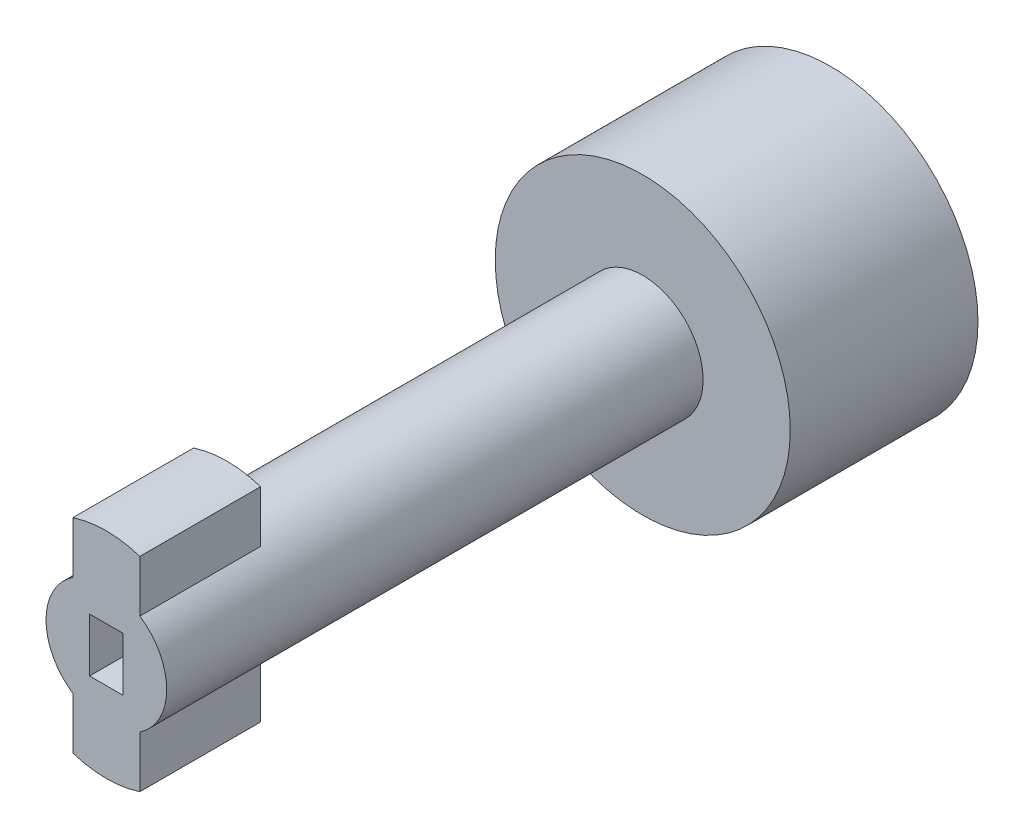
ISO-10303-21;
HEADER;
FILE_DESCRIPTION(('STEP AP214'),'2;1');
FILE_NAME('part.step','',(''),(''),'','','');
FILE_SCHEMA(('AUTOMOTIVE_DESIGN { 1 0 10303 214 1 1 1 1 }'));
ENDSEC;
DATA;
#1=APPLICATION_CONTEXT('core data for automotive mechanical design processes');
#2=APPLICATION_PROTOCOL_DEFINITION('international standard','automotive_design',2000,#1);
#3=PRODUCT_CONTEXT('',#1,'mechanical');
#4=PRODUCT('Part','Part','',(#3));
#5=PRODUCT_RELATED_PRODUCT_CATEGORY('part','',(#4));
#6=PRODUCT_DEFINITION_FORMATION('','',#4);
#7=PRODUCT_DEFINITION_CONTEXT('part definition',#1,'design');
#8=PRODUCT_DEFINITION('design','',#6,#7);
#9=PRODUCT_DEFINITION_SHAPE('','',#8);
#10=(LENGTH_UNIT() NAMED_UNIT(*) SI_UNIT(.MILLI.,.METRE.));
#11=(NAMED_UNIT(*) PLANE_ANGLE_UNIT() SI_UNIT($,.RADIAN.));
#12=(NAMED_UNIT(*) SI_UNIT($,.STERADIAN.) SOLID_ANGLE_UNIT());
#13=UNCERTAINTY_MEASURE_WITH_UNIT(LENGTH_MEASURE(1.E-05),#10,'distance_accuracy_value','');
#14=(GEOMETRIC_REPRESENTATION_CONTEXT(3) GLOBAL_UNCERTAINTY_ASSIGNED_CONTEXT((#13)) GLOBAL_UNIT_ASSIGNED_CONTEXT((#10,
#11,#12)) REPRESENTATION_CONTEXT('',''));
#15=CARTESIAN_POINT('',(0.,0.,0.));
#16=DIRECTION('',(0.,0.,1.));
#17=DIRECTION('',(1.,0.,0.));
#18=AXIS2_PLACEMENT_3D('',#15,#16,#17);
#19=CARTESIAN_POINT('',(0.,0.,25.));
#20=DIRECTION('',(0.,0.,1.));
#21=DIRECTION('',(1.,0.,0.));
#22=AXIS2_PLACEMENT_3D('',#19,#20,#21);
#23=PLANE('',#22);
#24=DIRECTION('',(0.,1.,0.));
#25=VECTOR('',#24,1.);
#26=CARTESIAN_POINT('',(1.25,2.,25.));
#27=LINE('',#26,#25);
#28=CARTESIAN_POINT('',(1.25,-2.,25.));
#29=VERTEX_POINT('',#28);
#30=CARTESIAN_POINT('',(1.25,2.,25.));
#31=VERTEX_POINT('',#30);
#32=EDGE_CURVE('E51',#29,#31,#27,.T.);
#33=ORIENTED_EDGE('',*,*,#32,.F.);
#34=DIRECTION('',(1.,0.,0.));
#35=VECTOR('',#34,1.);
#36=CARTESIAN_POINT('',(-1.25,-2.,25.));
#37=LINE('',#36,#35);
#38=CARTESIAN_POINT('',(-1.25,-2.,25.));
#39=VERTEX_POINT('',#38);
#40=EDGE_CURVE('E145',#39,#29,#37,.T.);
#41=ORIENTED_EDGE('',*,*,#40,.F.);
#42=DIRECTION('',(0.,-1.,0.));
#43=VECTOR('',#42,1.);
#44=CARTESIAN_POINT('',(-1.25,2.,25.));
#45=LINE('',#44,#43);
#46=CARTESIAN_POINT('',(-1.25,2.,25.));
#47=VERTEX_POINT('',#46);
#48=EDGE_CURVE('E148',#47,#39,#45,.T.);
#49=ORIENTED_EDGE('',*,*,#48,.F.);
#50=DIRECTION('',(-1.,0.,0.));
#51=VECTOR('',#50,1.);
#52=CARTESIAN_POINT('',(-1.25,2.,25.));
#53=LINE('',#52,#51);
#54=EDGE_CURVE('E157',#31,#47,#53,.T.);
#55=ORIENTED_EDGE('',*,*,#54,.F.);
#56=EDGE_LOOP('',(#33,#41,#49,#55));
#57=FACE_BOUND('',#56,.T.);
#58=DIRECTION('',(0.,1.,0.));
#59=VECTOR('',#58,1.);
#60=CARTESIAN_POINT('',(2.5,8.5,25.));
#61=LINE('',#60,#59);
#62=CARTESIAN_POINT('',(2.5,3.74165738677394,25.));
#63=VERTEX_POINT('',#62);
#64=CARTESIAN_POINT('',(2.5,7.59934207678533,25.));
#65=VERTEX_POINT('',#64);
#66=EDGE_CURVE('E180',#63,#65,#61,.T.);
#67=ORIENTED_EDGE('',*,*,#66,.T.);
#68=CARTESIAN_POINT('',(0.,0.,25.));
#69=DIRECTION('',(0.,0.,1.));
#70=DIRECTION('',(1.,0.,0.));
#71=AXIS2_PLACEMENT_3D('',#68,#69,#70);
#72=CIRCLE('',#71,8.);
#73=CARTESIAN_POINT('',(-2.5,7.59934207678533,25.));
#74=VERTEX_POINT('',#73);
#75=EDGE_CURVE('E170',#65,#74,#72,.T.);
#76=ORIENTED_EDGE('',*,*,#75,.T.);
#77=DIRECTION('',(0.,-1.,0.));
#78=VECTOR('',#77,1.);
#79=CARTESIAN_POINT('',(-2.5,8.5,25.));
#80=LINE('',#79,#78);
#81=CARTESIAN_POINT('',(-2.5,3.74165738677394,25.));
#82=VERTEX_POINT('',#81);
#83=EDGE_CURVE('E191',#74,#82,#80,.T.);
#84=ORIENTED_EDGE('',*,*,#83,.T.);
#85=CARTESIAN_POINT('',(0.,0.,25.));
#86=DIRECTION('',(0.,0.,1.));
#87=DIRECTION('',(1.,0.,0.));
#88=AXIS2_PLACEMENT_3D('',#85,#86,#87);
#89=CIRCLE('',#88,4.5);
#90=CARTESIAN_POINT('',(-2.5,-3.74165738677394,25.));
#91=VERTEX_POINT('',#90);
#92=EDGE_CURVE('E206',#82,#91,#89,.T.);
#93=ORIENTED_EDGE('',*,*,#92,.T.);
#94=CARTESIAN_POINT('',(-2.5,-7.59934207678533,25.));
#95=VERTEX_POINT('',#94);
#96=EDGE_CURVE('E190',#91,#95,#80,.T.);
#97=ORIENTED_EDGE('',*,*,#96,.T.);
#98=CARTESIAN_POINT('',(2.5,-7.59934207678533,25.));
#99=VERTEX_POINT('',#98);
#100=EDGE_CURVE('E163',#95,#99,#72,.T.);
#101=ORIENTED_EDGE('',*,*,#100,.T.);
#102=CARTESIAN_POINT('',(2.5,-3.74165738677394,25.));
#103=VERTEX_POINT('',#102);
#104=EDGE_CURVE('E188',#99,#103,#61,.T.);
#105=ORIENTED_EDGE('',*,*,#104,.T.);
#106=EDGE_CURVE('E204',#103,#63,#89,.T.);
#107=ORIENTED_EDGE('',*,*,#106,.T.);
#108=EDGE_LOOP('',(#67,#76,#84,#93,#97,#101,#105,#107));
#109=FACE_BOUND('',#108,.T.);
#110=ADVANCED_FACE('F36',(#57,#109),#23,.T.);
#111=CARTESIAN_POINT('',(0.,0.,16.));
#112=DIRECTION('',(0.,0.,1.));
#113=DIRECTION('',(1.,0.,0.));
#114=AXIS2_PLACEMENT_3D('',#111,#112,#113);
#115=PLANE('',#114);
#116=CARTESIAN_POINT('',(0.,0.,16.));
#117=DIRECTION('',(0.,0.,1.));
#118=DIRECTION('',(1.,0.,0.));
#119=AXIS2_PLACEMENT_3D('',#116,#117,#118);
#120=CIRCLE('',#119,8.);
#121=CARTESIAN_POINT('',(-2.5,-7.59934207678533,16.));
#122=VERTEX_POINT('',#121);
#123=CARTESIAN_POINT('',(2.5,-7.59934207678533,16.));
#124=VERTEX_POINT('',#123);
#125=EDGE_CURVE('E59',#122,#124,#120,.T.);
#126=ORIENTED_EDGE('',*,*,#125,.F.);
#127=DIRECTION('',(0.,-1.,0.));
#128=VECTOR('',#127,1.);
#129=CARTESIAN_POINT('',(-2.5,8.5,16.));
#130=LINE('',#129,#128);
#131=CARTESIAN_POINT('',(-2.5,-3.74165738677394,16.));
#132=VERTEX_POINT('',#131);
#133=EDGE_CURVE('E183',#132,#122,#130,.T.);
#134=ORIENTED_EDGE('',*,*,#133,.F.);
#135=CARTESIAN_POINT('',(0.,0.,16.));
#136=DIRECTION('',(0.,0.,1.));
#137=DIRECTION('',(1.,0.,0.));
#138=AXIS2_PLACEMENT_3D('',#135,#136,#137);
#139=CIRCLE('',#138,4.5);
#140=CARTESIAN_POINT('',(2.5,-3.74165738677394,16.));
#141=VERTEX_POINT('',#140);
#142=EDGE_CURVE('E207',#132,#141,#139,.T.);
#143=ORIENTED_EDGE('',*,*,#142,.T.);
#144=DIRECTION('',(0.,1.,0.));
#145=VECTOR('',#144,1.);
#146=CARTESIAN_POINT('',(2.5,8.5,16.));
#147=LINE('',#146,#145);
#148=EDGE_CURVE('E181',#124,#141,#147,.T.);
#149=ORIENTED_EDGE('',*,*,#148,.F.);
#150=EDGE_LOOP('',(#126,#134,#143,#149));
#151=FACE_BOUND('',#150,.T.);
#152=ADVANCED_FACE('F228',(#151),#115,.F.);
#153=CARTESIAN_POINT('',(-2.5,8.5,16.));
#154=DIRECTION('',(-1.,0.,0.));
#155=DIRECTION('',(0.,-1.,0.));
#156=AXIS2_PLACEMENT_3D('',#153,#154,#155);
#157=PLANE('',#156);
#158=ORIENTED_EDGE('',*,*,#133,.T.);
#159=DIRECTION('',(0.,0.,1.));
#160=VECTOR('',#159,1.);
#161=CARTESIAN_POINT('',(-2.5,-7.59934207678533,16.));
#162=LINE('',#161,#160);
#163=EDGE_CURVE('E177',#122,#95,#162,.T.);
#164=ORIENTED_EDGE('',*,*,#163,.T.);
#165=ORIENTED_EDGE('',*,*,#96,.F.);
#166=DIRECTION('',(0.,0.,-1.));
#167=VECTOR('',#166,1.);
#168=CARTESIAN_POINT('',(-2.5,-3.74165738677394,25.));
#169=LINE('',#168,#167);
#170=EDGE_CURVE('E187',#132,#91,#169,.F.);
#171=ORIENTED_EDGE('',*,*,#170,.F.);
#172=EDGE_LOOP('',(#158,#164,#165,#171));
#173=FACE_BOUND('',#172,.T.);
#174=ADVANCED_FACE('F227',(#173),#157,.T.);
#175=CARTESIAN_POINT('',(2.5,8.5,16.));
#176=DIRECTION('',(1.,0.,0.));
#177=DIRECTION('',(0.,1.,0.));
#178=AXIS2_PLACEMENT_3D('',#175,#176,#177);
#179=PLANE('',#178);
#180=ORIENTED_EDGE('',*,*,#104,.F.);
#181=DIRECTION('',(0.,0.,1.));
#182=VECTOR('',#181,1.);
#183=CARTESIAN_POINT('',(2.5,-7.59934207678533,16.));
#184=LINE('',#183,#182);
#185=EDGE_CURVE('E175',#99,#124,#184,.F.);
#186=ORIENTED_EDGE('',*,*,#185,.T.);
#187=ORIENTED_EDGE('',*,*,#148,.T.);
#188=DIRECTION('',(0.,0.,-1.));
#189=VECTOR('',#188,1.);
#190=CARTESIAN_POINT('',(2.5,-3.74165738677394,25.));
#191=LINE('',#190,#189);
#192=EDGE_CURVE('E201',#103,#141,#191,.T.);
#193=ORIENTED_EDGE('',*,*,#192,.F.);
#194=EDGE_LOOP('',(#180,#186,#187,#193));
#195=FACE_BOUND('',#194,.T.);
#196=ADVANCED_FACE('F232',(#195),#179,.T.);
#197=CARTESIAN_POINT('',(2.5,7.59934207678533,16.));
#198=VERTEX_POINT('',#197);
#199=CARTESIAN_POINT('',(-2.5,7.59934207678533,16.));
#200=VERTEX_POINT('',#199);
#201=EDGE_CURVE('E167',#198,#200,#120,.T.);
#202=ORIENTED_EDGE('',*,*,#201,.F.);
#203=CARTESIAN_POINT('',(2.5,3.74165738677394,16.));
#204=VERTEX_POINT('',#203);
#205=EDGE_CURVE('E184',#204,#198,#147,.T.);
#206=ORIENTED_EDGE('',*,*,#205,.F.);
#207=CARTESIAN_POINT('',(-2.5,3.74165738677394,16.));
#208=VERTEX_POINT('',#207);
#209=EDGE_CURVE('E44',#204,#208,#139,.T.);
#210=ORIENTED_EDGE('',*,*,#209,.T.);
#211=EDGE_CURVE('E185',#200,#208,#130,.T.);
#212=ORIENTED_EDGE('',*,*,#211,.F.);
#213=EDGE_LOOP('',(#202,#206,#210,#212));
#214=FACE_BOUND('',#213,.T.);
#215=ADVANCED_FACE('F241',(#214),#115,.F.);
#216=ORIENTED_EDGE('',*,*,#205,.T.);
#217=DIRECTION('',(0.,0.,1.));
#218=VECTOR('',#217,1.);
#219=CARTESIAN_POINT('',(2.5,7.59934207678533,16.));
#220=LINE('',#219,#218);
#221=EDGE_CURVE('E169',#198,#65,#220,.T.);
#222=ORIENTED_EDGE('',*,*,#221,.T.);
#223=ORIENTED_EDGE('',*,*,#66,.F.);
#224=DIRECTION('',(0.,0.,-1.));
#225=VECTOR('',#224,1.);
#226=CARTESIAN_POINT('',(2.5,3.74165738677394,25.));
#227=LINE('',#226,#225);
#228=EDGE_CURVE('E198',#204,#63,#227,.F.);
#229=ORIENTED_EDGE('',*,*,#228,.F.);
#230=EDGE_LOOP('',(#216,#222,#223,#229));
#231=FACE_BOUND('',#230,.T.);
#232=ADVANCED_FACE('F238',(#231),#179,.T.);
#233=ORIENTED_EDGE('',*,*,#83,.F.);
#234=DIRECTION('',(0.,0.,1.));
#235=VECTOR('',#234,1.);
#236=CARTESIAN_POINT('',(-2.5,7.59934207678533,16.));
#237=LINE('',#236,#235);
#238=EDGE_CURVE('E11',#74,#200,#237,.F.);
#239=ORIENTED_EDGE('',*,*,#238,.T.);
#240=ORIENTED_EDGE('',*,*,#211,.T.);
#241=DIRECTION('',(0.,0.,-1.));
#242=VECTOR('',#241,1.);
#243=CARTESIAN_POINT('',(-2.5,3.74165738677394,25.));
#244=LINE('',#243,#242);
#245=EDGE_CURVE('E195',#82,#208,#244,.T.);
#246=ORIENTED_EDGE('',*,*,#245,.F.);
#247=EDGE_LOOP('',(#233,#239,#240,#246));
#248=FACE_BOUND('',#247,.T.);
#249=ADVANCED_FACE('F246',(#248),#157,.T.);
#250=CARTESIAN_POINT('',(0.,0.,25.));
#251=DIRECTION('',(0.,0.,-1.));
#252=DIRECTION('',(-1.,0.,0.));
#253=AXIS2_PLACEMENT_3D('',#250,#251,#252);
#254=CYLINDRICAL_SURFACE('',#253,4.5);
#255=ORIENTED_EDGE('',*,*,#209,.F.);
#256=ORIENTED_EDGE('',*,*,#228,.T.);
#257=ORIENTED_EDGE('',*,*,#106,.F.);
#258=ORIENTED_EDGE('',*,*,#192,.T.);
#259=ORIENTED_EDGE('',*,*,#142,.F.);
#260=ORIENTED_EDGE('',*,*,#170,.T.);
#261=ORIENTED_EDGE('',*,*,#92,.F.);
#262=ORIENTED_EDGE('',*,*,#245,.T.);
#263=EDGE_LOOP('',(#255,#256,#257,#258,#259,#260,#261,#262));
#264=FACE_BOUND('',#263,.T.);
#265=CARTESIAN_POINT('',(0.,0.,-15.));
#266=DIRECTION('',(0.,0.,-1.));
#267=DIRECTION('',(-1.,0.,0.));
#268=AXIS2_PLACEMENT_3D('',#265,#266,#267);
#269=CIRCLE('',#268,4.5);
#270=CARTESIAN_POINT('',(-4.5,0.,-15.));
#271=VERTEX_POINT('',#270);
#272=EDGE_CURVE('E151',#271,#271,#269,.T.);
#273=ORIENTED_EDGE('',*,*,#272,.F.);
#274=EDGE_LOOP('',(#273));
#275=FACE_BOUND('',#274,.T.);
#276=ADVANCED_FACE('F38',(#264,#275),#254,.T.);
#277=CARTESIAN_POINT('',(0.,0.,16.));
#278=DIRECTION('',(0.,0.,1.));
#279=DIRECTION('',(1.,0.,0.));
#280=AXIS2_PLACEMENT_3D('',#277,#278,#279);
#281=CYLINDRICAL_SURFACE('',#280,8.);
#282=ORIENTED_EDGE('',*,*,#201,.T.);
#283=ORIENTED_EDGE('',*,*,#238,.F.);
#284=ORIENTED_EDGE('',*,*,#75,.F.);
#285=ORIENTED_EDGE('',*,*,#221,.F.);
#286=EDGE_LOOP('',(#282,#283,#284,#285));
#287=FACE_BOUND('',#286,.T.);
#288=ADVANCED_FACE('F244',(#287),#281,.T.);
#289=ORIENTED_EDGE('',*,*,#125,.T.);
#290=ORIENTED_EDGE('',*,*,#185,.F.);
#291=ORIENTED_EDGE('',*,*,#100,.F.);
#292=ORIENTED_EDGE('',*,*,#163,.F.);
#293=EDGE_LOOP('',(#289,#290,#291,#292));
#294=FACE_BOUND('',#293,.T.);
#295=ADVANCED_FACE('F234',(#294),#281,.T.);
#296=CARTESIAN_POINT('',(1.25,2.,20.));
#297=DIRECTION('',(1.,0.,0.));
#298=DIRECTION('',(0.,1.,0.));
#299=AXIS2_PLACEMENT_3D('',#296,#297,#298);
#300=PLANE('',#299);
#301=ORIENTED_EDGE('',*,*,#32,.T.);
#302=DIRECTION('',(0.,0.,1.));
#303=VECTOR('',#302,1.);
#304=CARTESIAN_POINT('',(1.25,2.,20.));
#305=LINE('',#304,#303);
#306=CARTESIAN_POINT('',(1.25,2.,20.));
#307=VERTEX_POINT('',#306);
#308=EDGE_CURVE('E123',#307,#31,#305,.T.);
#309=ORIENTED_EDGE('',*,*,#308,.F.);
#310=DIRECTION('',(0.,1.,0.));
#311=VECTOR('',#310,1.);
#312=CARTESIAN_POINT('',(1.25,2.,20.));
#313=LINE('',#312,#311);
#314=CARTESIAN_POINT('',(1.25,-2.,20.));
#315=VERTEX_POINT('',#314);
#316=EDGE_CURVE('E127',#315,#307,#313,.T.);
#317=ORIENTED_EDGE('',*,*,#316,.F.);
#318=DIRECTION('',(0.,0.,1.));
#319=VECTOR('',#318,1.);
#320=CARTESIAN_POINT('',(1.25,-2.,20.));
#321=LINE('',#320,#319);
#322=EDGE_CURVE('E161',#315,#29,#321,.T.);
#323=ORIENTED_EDGE('',*,*,#322,.T.);
#324=EDGE_LOOP('',(#301,#309,#317,#323));
#325=FACE_BOUND('',#324,.T.);
#326=ADVANCED_FACE('F125',(#325),#300,.F.);
#327=CARTESIAN_POINT('',(-1.25,-2.,20.));
#328=DIRECTION('',(0.,-1.,0.));
#329=DIRECTION('',(0.,0.,-1.));
#330=AXIS2_PLACEMENT_3D('',#327,#328,#329);
#331=PLANE('',#330);
#332=ORIENTED_EDGE('',*,*,#40,.T.);
#333=ORIENTED_EDGE('',*,*,#322,.F.);
#334=DIRECTION('',(1.,0.,0.));
#335=VECTOR('',#334,1.);
#336=CARTESIAN_POINT('',(-1.25,-2.,20.));
#337=LINE('',#336,#335);
#338=CARTESIAN_POINT('',(-1.25,-2.,20.));
#339=VERTEX_POINT('',#338);
#340=EDGE_CURVE('E133',#339,#315,#337,.T.);
#341=ORIENTED_EDGE('',*,*,#340,.F.);
#342=DIRECTION('',(0.,0.,1.));
#343=VECTOR('',#342,1.);
#344=CARTESIAN_POINT('',(-1.25,-2.,20.));
#345=LINE('',#344,#343);
#346=EDGE_CURVE('E164',#339,#39,#345,.T.);
#347=ORIENTED_EDGE('',*,*,#346,.T.);
#348=EDGE_LOOP('',(#332,#333,#341,#347));
#349=FACE_BOUND('',#348,.T.);
#350=ADVANCED_FACE('F272',(#349),#331,.F.);
#351=CARTESIAN_POINT('',(-1.25,2.,20.));
#352=DIRECTION('',(-1.,0.,0.));
#353=DIRECTION('',(0.,-1.,0.));
#354=AXIS2_PLACEMENT_3D('',#351,#352,#353);
#355=PLANE('',#354);
#356=ORIENTED_EDGE('',*,*,#48,.T.);
#357=ORIENTED_EDGE('',*,*,#346,.F.);
#358=DIRECTION('',(0.,-1.,0.));
#359=VECTOR('',#358,1.);
#360=CARTESIAN_POINT('',(-1.25,2.,20.));
#361=LINE('',#360,#359);
#362=CARTESIAN_POINT('',(-1.25,2.,20.));
#363=VERTEX_POINT('',#362);
#364=EDGE_CURVE('E141',#363,#339,#361,.T.);
#365=ORIENTED_EDGE('',*,*,#364,.F.);
#366=DIRECTION('',(0.,0.,1.));
#367=VECTOR('',#366,1.);
#368=CARTESIAN_POINT('',(-1.25,2.,20.));
#369=LINE('',#368,#367);
#370=EDGE_CURVE('E132',#363,#47,#369,.T.);
#371=ORIENTED_EDGE('',*,*,#370,.T.);
#372=EDGE_LOOP('',(#356,#357,#365,#371));
#373=FACE_BOUND('',#372,.T.);
#374=ADVANCED_FACE('F275',(#373),#355,.F.);
#375=CARTESIAN_POINT('',(-1.25,2.,20.));
#376=DIRECTION('',(0.,1.,0.));
#377=DIRECTION('',(0.,0.,1.));
#378=AXIS2_PLACEMENT_3D('',#375,#376,#377);
#379=PLANE('',#378);
#380=ORIENTED_EDGE('',*,*,#54,.T.);
#381=ORIENTED_EDGE('',*,*,#370,.F.);
#382=DIRECTION('',(-1.,0.,0.));
#383=VECTOR('',#382,1.);
#384=CARTESIAN_POINT('',(-1.25,2.,20.));
#385=LINE('',#384,#383);
#386=EDGE_CURVE('E136',#307,#363,#385,.T.);
#387=ORIENTED_EDGE('',*,*,#386,.F.);
#388=ORIENTED_EDGE('',*,*,#308,.T.);
#389=EDGE_LOOP('',(#380,#381,#387,#388));
#390=FACE_BOUND('',#389,.T.);
#391=ADVANCED_FACE('F137',(#390),#379,.F.);
#392=CARTESIAN_POINT('',(0.,0.,20.));
#393=DIRECTION('',(0.,0.,1.));
#394=DIRECTION('',(1.,0.,0.));
#395=AXIS2_PLACEMENT_3D('',#392,#393,#394);
#396=PLANE('',#395);
#397=ORIENTED_EDGE('',*,*,#316,.T.);
#398=ORIENTED_EDGE('',*,*,#386,.T.);
#399=ORIENTED_EDGE('',*,*,#364,.T.);
#400=ORIENTED_EDGE('',*,*,#340,.T.);
#401=EDGE_LOOP('',(#397,#398,#399,#400));
#402=FACE_BOUND('',#401,.T.);
#403=ADVANCED_FACE('F143',(#402),#396,.T.);
#404=CARTESIAN_POINT('',(0.,0.,-29.));
#405=DIRECTION('',(0.,0.,1.));
#406=DIRECTION('',(1.,0.,0.));
#407=AXIS2_PLACEMENT_3D('',#404,#405,#406);
#408=CYLINDRICAL_SURFACE('',#407,11.);
#409=CARTESIAN_POINT('',(0.,0.,-29.));
#410=DIRECTION('',(0.,0.,-1.));
#411=DIRECTION('',(-1.,0.,0.));
#412=AXIS2_PLACEMENT_3D('',#409,#410,#411);
#413=CIRCLE('',#412,11.);
#414=CARTESIAN_POINT('',(-11.,0.,-29.));
#415=VERTEX_POINT('',#414);
#416=EDGE_CURVE('E299',#415,#415,#413,.T.);
#417=ORIENTED_EDGE('',*,*,#416,.F.);
#418=EDGE_LOOP('',(#417));
#419=FACE_BOUND('',#418,.T.);
#420=CARTESIAN_POINT('',(0.,0.,-15.));
#421=DIRECTION('',(0.,0.,-1.));
#422=DIRECTION('',(-1.,0.,0.));
#423=AXIS2_PLACEMENT_3D('',#420,#421,#422);
#424=CIRCLE('',#423,11.);
#425=CARTESIAN_POINT('',(-11.,0.,-15.));
#426=VERTEX_POINT('',#425);
#427=EDGE_CURVE('E300',#426,#426,#424,.T.);
#428=ORIENTED_EDGE('',*,*,#427,.T.);
#429=EDGE_LOOP('',(#428));
#430=FACE_BOUND('',#429,.T.);
#431=ADVANCED_FACE('F284',(#419,#430),#408,.T.);
#432=CARTESIAN_POINT('',(0.,0.,-29.));
#433=DIRECTION('',(0.,0.,-1.));
#434=DIRECTION('',(-1.,0.,0.));
#435=AXIS2_PLACEMENT_3D('',#432,#433,#434);
#436=PLANE('',#435);
#437=ORIENTED_EDGE('',*,*,#416,.T.);
#438=EDGE_LOOP('',(#437));
#439=FACE_BOUND('',#438,.T.);
#440=ADVANCED_FACE('F287',(#439),#436,.T.);
#441=CARTESIAN_POINT('',(0.,0.,-15.));
#442=DIRECTION('',(0.,0.,-1.));
#443=DIRECTION('',(-1.,0.,0.));
#444=AXIS2_PLACEMENT_3D('',#441,#442,#443);
#445=PLANE('',#444);
#446=ORIENTED_EDGE('',*,*,#272,.T.);
#447=EDGE_LOOP('',(#446));
#448=FACE_BOUND('',#447,.T.);
#449=ORIENTED_EDGE('',*,*,#427,.F.);
#450=EDGE_LOOP('',(#449));
#451=FACE_BOUND('',#450,.T.);
#452=ADVANCED_FACE('F289',(#448,#451),#445,.F.);
#453=CLOSED_SHELL('',(#110,#152,#174,#196,#215,#232,#249,#276,#288,#295,#326,#350,#374,#391,
#403,#431,#440,#452));
#454=MANIFOLD_SOLID_BREP('B2',#453);
#455=ADVANCED_BREP_SHAPE_REPRESENTATION('',(#18,#454),#14);
#456=SHAPE_DEFINITION_REPRESENTATION(#9,#455);
ENDSEC;
END-ISO-10303-21;
